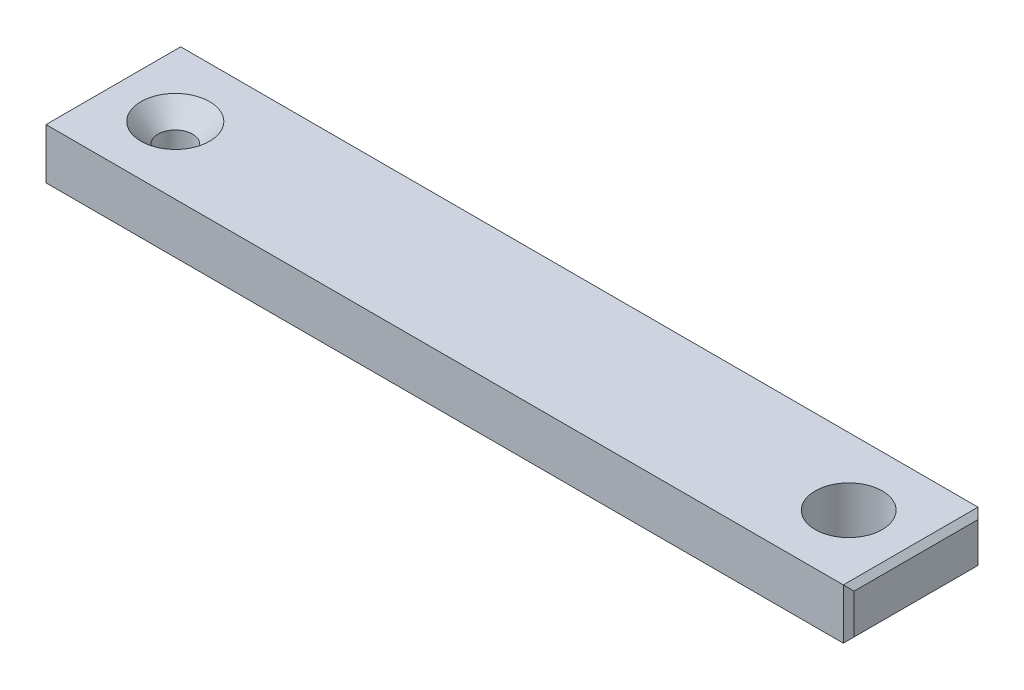
ISO-10303-21;
HEADER;
FILE_DESCRIPTION(('STEP AP214'),'2;1');
FILE_NAME('part.step','',(''),(''),'','','');
FILE_SCHEMA(('AUTOMOTIVE_DESIGN { 1 0 10303 214 1 1 1 1 }'));
ENDSEC;
DATA;
#1=APPLICATION_CONTEXT('core data for automotive mechanical design processes');
#2=APPLICATION_PROTOCOL_DEFINITION('international standard','automotive_design',2000,#1);
#3=PRODUCT_CONTEXT('',#1,'mechanical');
#4=PRODUCT('Part','Part','',(#3));
#5=PRODUCT_RELATED_PRODUCT_CATEGORY('part','',(#4));
#6=PRODUCT_DEFINITION_FORMATION('','',#4);
#7=PRODUCT_DEFINITION_CONTEXT('part definition',#1,'design');
#8=PRODUCT_DEFINITION('design','',#6,#7);
#9=PRODUCT_DEFINITION_SHAPE('','',#8);
#10=(LENGTH_UNIT() NAMED_UNIT(*) SI_UNIT(.MILLI.,.METRE.));
#11=(NAMED_UNIT(*) PLANE_ANGLE_UNIT() SI_UNIT($,.RADIAN.));
#12=(NAMED_UNIT(*) SI_UNIT($,.STERADIAN.) SOLID_ANGLE_UNIT());
#13=UNCERTAINTY_MEASURE_WITH_UNIT(LENGTH_MEASURE(1.E-05),#10,'distance_accuracy_value','');
#14=(GEOMETRIC_REPRESENTATION_CONTEXT(3) GLOBAL_UNCERTAINTY_ASSIGNED_CONTEXT((#13)) GLOBAL_UNIT_ASSIGNED_CONTEXT((#10,
#11,#12)) REPRESENTATION_CONTEXT('',''));
#15=CARTESIAN_POINT('',(0.,0.,0.));
#16=DIRECTION('',(0.,0.,1.));
#17=DIRECTION('',(1.,0.,0.));
#18=AXIS2_PLACEMENT_3D('',#15,#16,#17);
#19=CARTESIAN_POINT('',(0.,4.7625,6.35));
#20=DIRECTION('',(0.,0.,-1.));
#21=DIRECTION('',(-1.,0.,0.));
#22=AXIS2_PLACEMENT_3D('',#19,#20,#21);
#23=PLANE('',#22);
#24=DIRECTION('',(1.,0.,0.));
#25=VECTOR('',#24,1.);
#26=CARTESIAN_POINT('',(0.,4.7625,6.35));
#27=LINE('',#26,#25);
#28=CARTESIAN_POINT('',(-69.342,4.7625,6.35));
#29=VERTEX_POINT('',#28);
#30=CARTESIAN_POINT('',(5.84199999999999,4.7625,6.35));
#31=VERTEX_POINT('',#30);
#32=EDGE_CURVE('E181',#29,#31,#27,.T.);
#33=ORIENTED_EDGE('',*,*,#32,.F.);
#34=DIRECTION('',(0.,-1.,0.));
#35=VECTOR('',#34,1.);
#36=CARTESIAN_POINT('',(-69.342,4.7625,6.35));
#37=LINE('',#36,#35);
#38=CARTESIAN_POINT('',(-69.342,0.,6.35));
#39=VERTEX_POINT('',#38);
#40=EDGE_CURVE('E139',#29,#39,#37,.T.);
#41=ORIENTED_EDGE('',*,*,#40,.T.);
#42=DIRECTION('',(1.,0.,0.));
#43=VECTOR('',#42,1.);
#44=CARTESIAN_POINT('',(0.,0.,6.35));
#45=LINE('',#44,#43);
#46=CARTESIAN_POINT('',(5.84199999999999,0.,6.35));
#47=VERTEX_POINT('',#46);
#48=EDGE_CURVE('E182',#39,#47,#45,.T.);
#49=ORIENTED_EDGE('',*,*,#48,.T.);
#50=DIRECTION('',(0.,1.,0.));
#51=VECTOR('',#50,1.);
#52=CARTESIAN_POINT('',(5.84199999999999,4.7625,6.35));
#53=LINE('',#52,#51);
#54=EDGE_CURVE('E136',#47,#31,#53,.T.);
#55=ORIENTED_EDGE('',*,*,#54,.T.);
#56=EDGE_LOOP('',(#33,#41,#49,#55));
#57=FACE_BOUND('',#56,.T.);
#58=ADVANCED_FACE('F34',(#57),#23,.F.);
#59=CARTESIAN_POINT('',(6.34999999999999,4.7625,0.));
#60=DIRECTION('',(1.,0.,0.));
#61=DIRECTION('',(0.,0.,-1.));
#62=AXIS2_PLACEMENT_3D('',#59,#60,#61);
#63=PLANE('',#62);
#64=DIRECTION('',(0.,0.,1.));
#65=VECTOR('',#64,1.);
#66=CARTESIAN_POINT('',(6.34999999999999,4.25449999999999,0.));
#67=LINE('',#66,#65);
#68=CARTESIAN_POINT('',(6.34999999999999,4.25449999999999,-5.84199999999999));
#69=VERTEX_POINT('',#68);
#70=CARTESIAN_POINT('',(6.34999999999999,4.25449999999999,5.84199999999999));
#71=VERTEX_POINT('',#70);
#72=EDGE_CURVE('E43',#69,#71,#67,.T.);
#73=ORIENTED_EDGE('',*,*,#72,.T.);
#74=DIRECTION('',(0.,-1.,0.));
#75=VECTOR('',#74,1.);
#76=CARTESIAN_POINT('',(6.34999999999999,0.,5.84199999999999));
#77=LINE('',#76,#75);
#78=CARTESIAN_POINT('',(6.34999999999999,0.508000000000008,5.84199999999999));
#79=VERTEX_POINT('',#78);
#80=EDGE_CURVE('E11',#71,#79,#77,.T.);
#81=ORIENTED_EDGE('',*,*,#80,.T.);
#82=DIRECTION('',(0.,0.,-1.));
#83=VECTOR('',#82,1.);
#84=CARTESIAN_POINT('',(6.34999999999999,0.508000000000008,-6.35));
#85=LINE('',#84,#83);
#86=CARTESIAN_POINT('',(6.34999999999999,0.508000000000008,-5.84199999999999));
#87=VERTEX_POINT('',#86);
#88=EDGE_CURVE('E145',#79,#87,#85,.T.);
#89=ORIENTED_EDGE('',*,*,#88,.T.);
#90=DIRECTION('',(0.,1.,0.));
#91=VECTOR('',#90,1.);
#92=CARTESIAN_POINT('',(6.34999999999999,4.7625,-5.84199999999999));
#93=LINE('',#92,#91);
#94=EDGE_CURVE('E54',#87,#69,#93,.T.);
#95=ORIENTED_EDGE('',*,*,#94,.T.);
#96=EDGE_LOOP('',(#73,#81,#89,#95));
#97=FACE_BOUND('',#96,.T.);
#98=ADVANCED_FACE('F239',(#97),#63,.T.);
#99=CARTESIAN_POINT('',(0.,4.7625,-6.35));
#100=DIRECTION('',(0.,0.,-1.));
#101=DIRECTION('',(-1.,0.,0.));
#102=AXIS2_PLACEMENT_3D('',#99,#100,#101);
#103=PLANE('',#102);
#104=DIRECTION('',(1.,0.,0.));
#105=VECTOR('',#104,1.);
#106=CARTESIAN_POINT('',(0.,0.,-6.35));
#107=LINE('',#106,#105);
#108=CARTESIAN_POINT('',(-69.342,0.,-6.35));
#109=VERTEX_POINT('',#108);
#110=CARTESIAN_POINT('',(5.84199999999999,0.,-6.35));
#111=VERTEX_POINT('',#110);
#112=EDGE_CURVE('E175',#109,#111,#107,.T.);
#113=ORIENTED_EDGE('',*,*,#112,.F.);
#114=DIRECTION('',(0.,1.,0.));
#115=VECTOR('',#114,1.);
#116=CARTESIAN_POINT('',(-69.342,4.7625,-6.35));
#117=LINE('',#116,#115);
#118=CARTESIAN_POINT('',(-69.342,4.7625,-6.35));
#119=VERTEX_POINT('',#118);
#120=EDGE_CURVE('E106',#109,#119,#117,.T.);
#121=ORIENTED_EDGE('',*,*,#120,.T.);
#122=DIRECTION('',(1.,0.,0.));
#123=VECTOR('',#122,1.);
#124=CARTESIAN_POINT('',(0.,4.7625,-6.35));
#125=LINE('',#124,#123);
#126=CARTESIAN_POINT('',(5.84199999999999,4.7625,-6.35));
#127=VERTEX_POINT('',#126);
#128=EDGE_CURVE('E119',#119,#127,#125,.T.);
#129=ORIENTED_EDGE('',*,*,#128,.T.);
#130=DIRECTION('',(0.,-1.,0.));
#131=VECTOR('',#130,1.);
#132=CARTESIAN_POINT('',(5.84199999999999,4.7625,-6.35));
#133=LINE('',#132,#131);
#134=EDGE_CURVE('E125',#127,#111,#133,.T.);
#135=ORIENTED_EDGE('',*,*,#134,.T.);
#136=EDGE_LOOP('',(#113,#121,#129,#135));
#137=FACE_BOUND('',#136,.T.);
#138=ADVANCED_FACE('F174',(#137),#103,.T.);
#139=CARTESIAN_POINT('',(-69.85,4.7625,0.));
#140=DIRECTION('',(1.,0.,0.));
#141=DIRECTION('',(0.,0.,-1.));
#142=AXIS2_PLACEMENT_3D('',#139,#140,#141);
#143=PLANE('',#142);
#144=DIRECTION('',(0.,0.,-1.));
#145=VECTOR('',#144,1.);
#146=CARTESIAN_POINT('',(-69.85,4.25450000000001,-6.35));
#147=LINE('',#146,#145);
#148=CARTESIAN_POINT('',(-69.85,4.25450000000001,5.84200000000001));
#149=VERTEX_POINT('',#148);
#150=CARTESIAN_POINT('',(-69.85,4.25450000000001,-5.84200000000001));
#151=VERTEX_POINT('',#150);
#152=EDGE_CURVE('E123',#149,#151,#147,.T.);
#153=ORIENTED_EDGE('',*,*,#152,.T.);
#154=DIRECTION('',(0.,-1.,0.));
#155=VECTOR('',#154,1.);
#156=CARTESIAN_POINT('',(-69.85,0.,-5.84200000000001));
#157=LINE('',#156,#155);
#158=CARTESIAN_POINT('',(-69.85,0.507999999999995,-5.84200000000001));
#159=VERTEX_POINT('',#158);
#160=EDGE_CURVE('E104',#151,#159,#157,.T.);
#161=ORIENTED_EDGE('',*,*,#160,.T.);
#162=DIRECTION('',(0.,0.,1.));
#163=VECTOR('',#162,1.);
#164=CARTESIAN_POINT('',(-69.85,0.507999999999995,0.));
#165=LINE('',#164,#163);
#166=CARTESIAN_POINT('',(-69.85,0.507999999999995,5.84200000000001));
#167=VERTEX_POINT('',#166);
#168=EDGE_CURVE('E112',#159,#167,#165,.T.);
#169=ORIENTED_EDGE('',*,*,#168,.T.);
#170=DIRECTION('',(0.,1.,0.));
#171=VECTOR('',#170,1.);
#172=CARTESIAN_POINT('',(-69.85,4.7625,5.84200000000001));
#173=LINE('',#172,#171);
#174=EDGE_CURVE('E118',#167,#149,#173,.T.);
#175=ORIENTED_EDGE('',*,*,#174,.T.);
#176=EDGE_LOOP('',(#153,#161,#169,#175));
#177=FACE_BOUND('',#176,.T.);
#178=ADVANCED_FACE('F121',(#177),#143,.F.);
#179=CARTESIAN_POINT('',(0.,4.7625,0.));
#180=DIRECTION('',(0.,1.,0.));
#181=DIRECTION('',(0.,0.,1.));
#182=AXIS2_PLACEMENT_3D('',#179,#180,#181);
#183=PLANE('',#182);
#184=CARTESIAN_POINT('',(0.,4.7625,0.));
#185=DIRECTION('',(0.,1.,0.));
#186=DIRECTION('',(0.,0.,1.));
#187=AXIS2_PLACEMENT_3D('',#184,#185,#186);
#188=CIRCLE('',#187,3.1623);
#189=CARTESIAN_POINT('',(0.,4.7625,3.1623));
#190=VERTEX_POINT('',#189);
#191=EDGE_CURVE('E154',#190,#190,#188,.T.);
#192=ORIENTED_EDGE('',*,*,#191,.F.);
#193=EDGE_LOOP('',(#192));
#194=FACE_BOUND('',#193,.T.);
#195=CARTESIAN_POINT('',(-63.5,4.7625,0.));
#196=DIRECTION('',(0.,1.,0.));
#197=DIRECTION('',(0.,0.,1.));
#198=AXIS2_PLACEMENT_3D('',#195,#196,#197);
#199=CIRCLE('',#198,3.2385);
#200=CARTESIAN_POINT('',(-63.5,4.7625,3.2385));
#201=VERTEX_POINT('',#200);
#202=EDGE_CURVE('E205',#201,#201,#199,.T.);
#203=ORIENTED_EDGE('',*,*,#202,.F.);
#204=EDGE_LOOP('',(#203));
#205=FACE_BOUND('',#204,.T.);
#206=ORIENTED_EDGE('',*,*,#128,.F.);
#207=DIRECTION('',(0.,0.,1.));
#208=VECTOR('',#207,1.);
#209=CARTESIAN_POINT('',(-69.342,4.7625,6.35));
#210=LINE('',#209,#208);
#211=EDGE_CURVE('E134',#119,#29,#210,.T.);
#212=ORIENTED_EDGE('',*,*,#211,.T.);
#213=ORIENTED_EDGE('',*,*,#32,.T.);
#214=DIRECTION('',(0.,0.,-1.));
#215=VECTOR('',#214,1.);
#216=CARTESIAN_POINT('',(5.84199999999999,4.7625,0.));
#217=LINE('',#216,#215);
#218=EDGE_CURVE('E132',#31,#127,#217,.T.);
#219=ORIENTED_EDGE('',*,*,#218,.T.);
#220=EDGE_LOOP('',(#206,#212,#213,#219));
#221=FACE_BOUND('',#220,.T.);
#222=ADVANCED_FACE('F198',(#194,#205,#221),#183,.T.);
#223=CARTESIAN_POINT('',(0.,0.,0.));
#224=DIRECTION('',(0.,1.,0.));
#225=DIRECTION('',(0.,0.,1.));
#226=AXIS2_PLACEMENT_3D('',#223,#224,#225);
#227=PLANE('',#226);
#228=CARTESIAN_POINT('',(0.,0.,0.));
#229=DIRECTION('',(0.,1.,0.));
#230=DIRECTION('',(0.,0.,1.));
#231=AXIS2_PLACEMENT_3D('',#228,#229,#230);
#232=CIRCLE('',#231,3.1623);
#233=CARTESIAN_POINT('',(0.,0.,3.1623));
#234=VERTEX_POINT('',#233);
#235=EDGE_CURVE('E208',#234,#234,#232,.T.);
#236=ORIENTED_EDGE('',*,*,#235,.T.);
#237=EDGE_LOOP('',(#236));
#238=FACE_BOUND('',#237,.T.);
#239=CARTESIAN_POINT('',(-63.5,0.,0.));
#240=DIRECTION('',(0.,1.,0.));
#241=DIRECTION('',(0.,0.,1.));
#242=AXIS2_PLACEMENT_3D('',#239,#240,#241);
#243=CIRCLE('',#242,1.63195);
#244=CARTESIAN_POINT('',(-63.5,0.,1.63195));
#245=VERTEX_POINT('',#244);
#246=EDGE_CURVE('E186',#245,#245,#243,.T.);
#247=ORIENTED_EDGE('',*,*,#246,.T.);
#248=EDGE_LOOP('',(#247));
#249=FACE_BOUND('',#248,.T.);
#250=ORIENTED_EDGE('',*,*,#48,.F.);
#251=DIRECTION('',(0.,0.,-1.));
#252=VECTOR('',#251,1.);
#253=CARTESIAN_POINT('',(-69.342,0.,0.));
#254=LINE('',#253,#252);
#255=EDGE_CURVE('E143',#39,#109,#254,.T.);
#256=ORIENTED_EDGE('',*,*,#255,.T.);
#257=ORIENTED_EDGE('',*,*,#112,.T.);
#258=DIRECTION('',(0.,0.,1.));
#259=VECTOR('',#258,1.);
#260=CARTESIAN_POINT('',(5.84199999999999,0.,6.35));
#261=LINE('',#260,#259);
#262=EDGE_CURVE('E141',#111,#47,#261,.T.);
#263=ORIENTED_EDGE('',*,*,#262,.T.);
#264=EDGE_LOOP('',(#250,#256,#257,#263));
#265=FACE_BOUND('',#264,.T.);
#266=ADVANCED_FACE('F179',(#238,#249,#265),#227,.F.);
#267=CARTESIAN_POINT('',(-63.5,4.7625,0.));
#268=DIRECTION('',(0.,1.,0.));
#269=DIRECTION('',(0.,0.,1.));
#270=AXIS2_PLACEMENT_3D('',#267,#268,#269);
#271=CYLINDRICAL_SURFACE('',#270,1.63195);
#272=ORIENTED_EDGE('',*,*,#246,.F.);
#273=EDGE_LOOP('',(#272));
#274=FACE_BOUND('',#273,.T.);
#275=CARTESIAN_POINT('',(-63.5,2.91437563537909,0.));
#276=DIRECTION('',(0.,1.,0.));
#277=DIRECTION('',(0.,0.,1.));
#278=AXIS2_PLACEMENT_3D('',#275,#276,#277);
#279=CIRCLE('',#278,1.63195);
#280=CARTESIAN_POINT('',(-63.5,2.91437563537909,1.63195));
#281=VERTEX_POINT('',#280);
#282=EDGE_CURVE('E202',#281,#281,#279,.T.);
#283=ORIENTED_EDGE('',*,*,#282,.T.);
#284=EDGE_LOOP('',(#283));
#285=FACE_BOUND('',#284,.T.);
#286=ADVANCED_FACE('F229',(#274,#285),#271,.F.);
#287=CARTESIAN_POINT('',(-63.5,4.7625,0.));
#288=DIRECTION('',(0.,1.,0.));
#289=DIRECTION('',(0.,0.,1.));
#290=AXIS2_PLACEMENT_3D('',#287,#288,#289);
#291=CONICAL_SURFACE('',#290,3.2385,0.715584993317675);
#292=ORIENTED_EDGE('',*,*,#282,.F.);
#293=EDGE_LOOP('',(#292));
#294=FACE_BOUND('',#293,.T.);
#295=ORIENTED_EDGE('',*,*,#202,.T.);
#296=EDGE_LOOP('',(#295));
#297=FACE_BOUND('',#296,.T.);
#298=ADVANCED_FACE('F219',(#294,#297),#291,.F.);
#299=CARTESIAN_POINT('',(0.,0.,0.));
#300=DIRECTION('',(0.,1.,0.));
#301=DIRECTION('',(0.,0.,1.));
#302=AXIS2_PLACEMENT_3D('',#299,#300,#301);
#303=CYLINDRICAL_SURFACE('',#302,3.1623);
#304=ORIENTED_EDGE('',*,*,#235,.F.);
#305=EDGE_LOOP('',(#304));
#306=FACE_BOUND('',#305,.T.);
#307=ORIENTED_EDGE('',*,*,#191,.T.);
#308=EDGE_LOOP('',(#307));
#309=FACE_BOUND('',#308,.T.);
#310=ADVANCED_FACE('F216',(#306,#309),#303,.F.);
#311=CARTESIAN_POINT('',(-69.342,4.7625,6.35));
#312=DIRECTION('',(0.707106781186538,0.,-0.707106781186557));
#313=DIRECTION('',(0.,-1.,0.));
#314=AXIS2_PLACEMENT_3D('',#311,#312,#313);
#315=PLANE('',#314);
#316=DIRECTION('',(-0.577350269189631,0.577350269189631,-0.577350269189616));
#317=VECTOR('',#316,1.);
#318=CARTESIAN_POINT('',(-71.7973333333333,2.45533333333331,3.89466666666674));
#319=LINE('',#318,#317);
#320=EDGE_CURVE('E115',#39,#167,#319,.T.);
#321=ORIENTED_EDGE('',*,*,#320,.F.);
#322=ORIENTED_EDGE('',*,*,#40,.F.);
#323=DIRECTION('',(0.577350269189631,0.577350269189631,0.577350269189616));
#324=VECTOR('',#323,1.);
#325=CARTESIAN_POINT('',(-69.342,4.76250000000001,6.35));
#326=LINE('',#325,#324);
#327=EDGE_CURVE('E151',#149,#29,#326,.T.);
#328=ORIENTED_EDGE('',*,*,#327,.F.);
#329=ORIENTED_EDGE('',*,*,#174,.F.);
#330=EDGE_LOOP('',(#321,#322,#328,#329));
#331=FACE_BOUND('',#330,.T.);
#332=ADVANCED_FACE('F192',(#331),#315,.F.);
#333=CARTESIAN_POINT('',(-69.342,4.7625,0.));
#334=DIRECTION('',(-0.707106781186548,0.707106781186548,0.));
#335=DIRECTION('',(0.,0.,-1.));
#336=AXIS2_PLACEMENT_3D('',#333,#334,#335);
#337=PLANE('',#336);
#338=ORIENTED_EDGE('',*,*,#327,.T.);
#339=ORIENTED_EDGE('',*,*,#211,.F.);
#340=DIRECTION('',(-0.577350269189631,-0.577350269189631,0.577350269189616));
#341=VECTOR('',#340,1.);
#342=CARTESIAN_POINT('',(-71.4586666666667,2.64583333333336,-4.2333333333334));
#343=LINE('',#342,#341);
#344=EDGE_CURVE('E109',#151,#119,#343,.F.);
#345=ORIENTED_EDGE('',*,*,#344,.F.);
#346=ORIENTED_EDGE('',*,*,#152,.F.);
#347=EDGE_LOOP('',(#338,#339,#345,#346));
#348=FACE_BOUND('',#347,.T.);
#349=ADVANCED_FACE('F195',(#348),#337,.T.);
#350=CARTESIAN_POINT('',(-69.85,0.507999999999995,0.));
#351=DIRECTION('',(0.707106781186548,0.707106781186548,0.));
#352=DIRECTION('',(0.,0.,1.));
#353=AXIS2_PLACEMENT_3D('',#350,#351,#352);
#354=PLANE('',#353);
#355=ORIENTED_EDGE('',*,*,#320,.T.);
#356=ORIENTED_EDGE('',*,*,#168,.F.);
#357=DIRECTION('',(-0.577350269189631,0.577350269189631,0.577350269189616));
#358=VECTOR('',#357,1.);
#359=CARTESIAN_POINT('',(-71.7973333333333,2.45533333333331,-3.89466666666674));
#360=LINE('',#359,#358);
#361=EDGE_CURVE('E100',#109,#159,#360,.T.);
#362=ORIENTED_EDGE('',*,*,#361,.F.);
#363=ORIENTED_EDGE('',*,*,#255,.F.);
#364=EDGE_LOOP('',(#355,#356,#362,#363));
#365=FACE_BOUND('',#364,.T.);
#366=ADVANCED_FACE('F113',(#365),#354,.F.);
#367=CARTESIAN_POINT('',(-69.85,4.7625,-5.84200000000001));
#368=DIRECTION('',(-0.707106781186538,0.,-0.707106781186557));
#369=DIRECTION('',(0.,1.,0.));
#370=AXIS2_PLACEMENT_3D('',#367,#368,#369);
#371=PLANE('',#370);
#372=ORIENTED_EDGE('',*,*,#344,.T.);
#373=ORIENTED_EDGE('',*,*,#120,.F.);
#374=ORIENTED_EDGE('',*,*,#361,.T.);
#375=ORIENTED_EDGE('',*,*,#160,.F.);
#376=EDGE_LOOP('',(#372,#373,#374,#375));
#377=FACE_BOUND('',#376,.T.);
#378=ADVANCED_FACE('F102',(#377),#371,.T.);
#379=CARTESIAN_POINT('',(5.84199999999999,4.7625,-6.35));
#380=DIRECTION('',(-0.707106781186552,0.,0.707106781186543));
#381=DIRECTION('',(0.,-1.,0.));
#382=AXIS2_PLACEMENT_3D('',#379,#380,#381);
#383=PLANE('',#382);
#384=DIRECTION('',(-0.577350269189621,-0.577350269189628,-0.577350269189628));
#385=VECTOR('',#384,1.);
#386=CARTESIAN_POINT('',(7.95866666666665,2.11666666666669,-4.23333333333331));
#387=LINE('',#386,#385);
#388=EDGE_CURVE('E158',#111,#87,#387,.F.);
#389=ORIENTED_EDGE('',*,*,#388,.F.);
#390=ORIENTED_EDGE('',*,*,#134,.F.);
#391=DIRECTION('',(0.577350269189621,-0.577350269189628,0.577350269189628));
#392=VECTOR('',#391,1.);
#393=CARTESIAN_POINT('',(5.84199999999999,4.7625,-6.35));
#394=LINE('',#393,#392);
#395=EDGE_CURVE('E38',#69,#127,#394,.F.);
#396=ORIENTED_EDGE('',*,*,#395,.F.);
#397=ORIENTED_EDGE('',*,*,#94,.F.);
#398=EDGE_LOOP('',(#389,#390,#396,#397));
#399=FACE_BOUND('',#398,.T.);
#400=ADVANCED_FACE('F36',(#399),#383,.F.);
#401=CARTESIAN_POINT('',(6.34999999999999,4.25449999999999,0.));
#402=DIRECTION('',(-0.707106781186552,-0.707106781186543,0.));
#403=DIRECTION('',(0.,0.,1.));
#404=AXIS2_PLACEMENT_3D('',#401,#402,#403);
#405=PLANE('',#404);
#406=ORIENTED_EDGE('',*,*,#395,.T.);
#407=ORIENTED_EDGE('',*,*,#218,.F.);
#408=DIRECTION('',(-0.577350269189621,0.577350269189628,0.577350269189628));
#409=VECTOR('',#408,1.);
#410=CARTESIAN_POINT('',(8.29733333333332,2.30716666666664,3.89466666666664));
#411=LINE('',#410,#409);
#412=EDGE_CURVE('E157',#71,#31,#411,.T.);
#413=ORIENTED_EDGE('',*,*,#412,.F.);
#414=ORIENTED_EDGE('',*,*,#72,.F.);
#415=EDGE_LOOP('',(#406,#407,#413,#414));
#416=FACE_BOUND('',#415,.T.);
#417=ADVANCED_FACE('F167',(#416),#405,.F.);
#418=CARTESIAN_POINT('',(5.84199999999999,0.,0.));
#419=DIRECTION('',(0.707106781186552,-0.707106781186543,0.));
#420=DIRECTION('',(0.,0.,-1.));
#421=AXIS2_PLACEMENT_3D('',#418,#419,#420);
#422=PLANE('',#421);
#423=ORIENTED_EDGE('',*,*,#388,.T.);
#424=ORIENTED_EDGE('',*,*,#88,.F.);
#425=DIRECTION('',(-0.577350269189621,-0.577350269189628,0.577350269189628));
#426=VECTOR('',#425,1.);
#427=CARTESIAN_POINT('',(7.95866666666665,2.11666666666669,4.23333333333331));
#428=LINE('',#427,#426);
#429=EDGE_CURVE('E155',#47,#79,#428,.F.);
#430=ORIENTED_EDGE('',*,*,#429,.F.);
#431=ORIENTED_EDGE('',*,*,#262,.F.);
#432=EDGE_LOOP('',(#423,#424,#430,#431));
#433=FACE_BOUND('',#432,.T.);
#434=ADVANCED_FACE('F259',(#433),#422,.T.);
#435=CARTESIAN_POINT('',(6.34999999999999,4.7625,5.84199999999999));
#436=DIRECTION('',(0.707106781186552,0.,0.707106781186543));
#437=DIRECTION('',(0.,1.,0.));
#438=AXIS2_PLACEMENT_3D('',#435,#436,#437);
#439=PLANE('',#438);
#440=ORIENTED_EDGE('',*,*,#412,.T.);
#441=ORIENTED_EDGE('',*,*,#54,.F.);
#442=ORIENTED_EDGE('',*,*,#429,.T.);
#443=ORIENTED_EDGE('',*,*,#80,.F.);
#444=EDGE_LOOP('',(#440,#441,#442,#443));
#445=FACE_BOUND('',#444,.T.);
#446=ADVANCED_FACE('F256',(#445),#439,.T.);
#447=CLOSED_SHELL('',(#58,#98,#138,#178,#222,#266,#286,#298,#310,#332,#349,#366,#378,#400,#417,
#434,#446));
#448=MANIFOLD_SOLID_BREP('B2',#447);
#449=ADVANCED_BREP_SHAPE_REPRESENTATION('',(#18,#448),#14);
#450=SHAPE_DEFINITION_REPRESENTATION(#9,#449);
ENDSEC;
END-ISO-10303-21;
